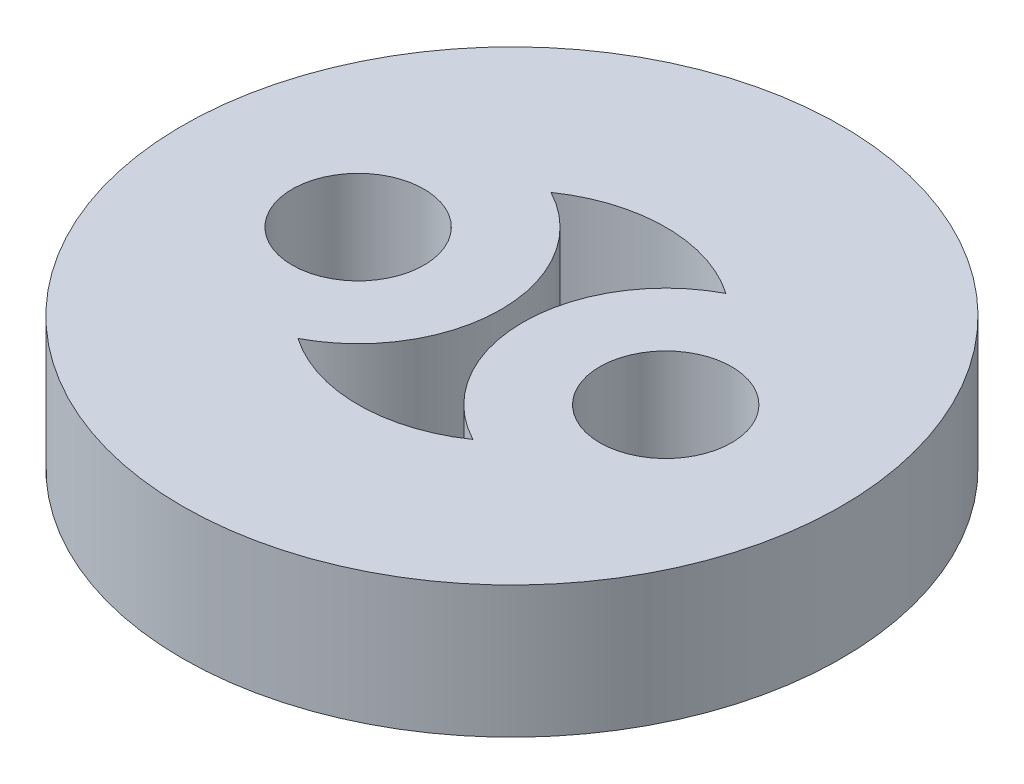
ISO-10303-21;
HEADER;
FILE_DESCRIPTION(('STEP AP214'),'2;1');
FILE_NAME('part.step','',(''),(''),'','','');
FILE_SCHEMA(('AUTOMOTIVE_DESIGN { 1 0 10303 214 1 1 1 1 }'));
ENDSEC;
DATA;
#1=APPLICATION_CONTEXT('core data for automotive mechanical design processes');
#2=APPLICATION_PROTOCOL_DEFINITION('international standard','automotive_design',2000,#1);
#3=PRODUCT_CONTEXT('',#1,'mechanical');
#4=PRODUCT('Part','Part','',(#3));
#5=PRODUCT_RELATED_PRODUCT_CATEGORY('part','',(#4));
#6=PRODUCT_DEFINITION_FORMATION('','',#4);
#7=PRODUCT_DEFINITION_CONTEXT('part definition',#1,'design');
#8=PRODUCT_DEFINITION('design','',#6,#7);
#9=PRODUCT_DEFINITION_SHAPE('','',#8);
#10=(LENGTH_UNIT() NAMED_UNIT(*) SI_UNIT(.MILLI.,.METRE.));
#11=(NAMED_UNIT(*) PLANE_ANGLE_UNIT() SI_UNIT($,.RADIAN.));
#12=(NAMED_UNIT(*) SI_UNIT($,.STERADIAN.) SOLID_ANGLE_UNIT());
#13=UNCERTAINTY_MEASURE_WITH_UNIT(LENGTH_MEASURE(1.E-05),#10,'distance_accuracy_value','');
#14=(GEOMETRIC_REPRESENTATION_CONTEXT(3) GLOBAL_UNCERTAINTY_ASSIGNED_CONTEXT((#13)) GLOBAL_UNIT_ASSIGNED_CONTEXT((#10,
#11,#12)) REPRESENTATION_CONTEXT('',''));
#15=CARTESIAN_POINT('',(0.,0.,0.));
#16=DIRECTION('',(0.,0.,1.));
#17=DIRECTION('',(1.,0.,0.));
#18=AXIS2_PLACEMENT_3D('',#15,#16,#17);
#19=CARTESIAN_POINT('',(0.,3.,0.));
#20=DIRECTION('',(0.,1.,0.));
#21=DIRECTION('',(0.,0.,1.));
#22=AXIS2_PLACEMENT_3D('',#19,#20,#21);
#23=PLANE('',#22);
#24=CARTESIAN_POINT('',(-3.5,3.,0.));
#25=DIRECTION('',(0.,1.,0.));
#26=DIRECTION('',(0.,0.,1.));
#27=AXIS2_PLACEMENT_3D('',#24,#25,#26);
#28=CIRCLE('',#27,1.5);
#29=CARTESIAN_POINT('',(-3.5,3.,1.5));
#30=VERTEX_POINT('',#29);
#31=EDGE_CURVE('E116',#30,#30,#28,.T.);
#32=ORIENTED_EDGE('',*,*,#31,.F.);
#33=EDGE_LOOP('',(#32));
#34=FACE_BOUND('',#33,.T.);
#35=CARTESIAN_POINT('',(0.,3.,0.));
#36=DIRECTION('',(0.,1.,0.));
#37=DIRECTION('',(0.,0.,1.));
#38=AXIS2_PLACEMENT_3D('',#35,#36,#37);
#39=CIRCLE('',#38,7.5);
#40=CARTESIAN_POINT('',(0.,3.,7.5));
#41=VERTEX_POINT('',#40);
#42=EDGE_CURVE('E11',#41,#41,#39,.T.);
#43=ORIENTED_EDGE('',*,*,#42,.T.);
#44=EDGE_LOOP('',(#43));
#45=FACE_BOUND('',#44,.T.);
#46=CARTESIAN_POINT('',(3.5,3.,0.));
#47=DIRECTION('',(0.,1.,0.));
#48=DIRECTION('',(0.,0.,1.));
#49=AXIS2_PLACEMENT_3D('',#46,#47,#48);
#50=CIRCLE('',#49,1.5);
#51=CARTESIAN_POINT('',(3.5,3.,1.5));
#52=VERTEX_POINT('',#51);
#53=EDGE_CURVE('E110',#52,#52,#50,.T.);
#54=ORIENTED_EDGE('',*,*,#53,.F.);
#55=EDGE_LOOP('',(#54));
#56=FACE_BOUND('',#55,.T.);
#57=CARTESIAN_POINT('',(-3.5,3.,0.));
#58=DIRECTION('',(0.,-1.,0.));
#59=DIRECTION('',(0.,0.,1.));
#60=AXIS2_PLACEMENT_3D('',#57,#58,#59);
#61=CIRCLE('',#60,3.25);
#62=CARTESIAN_POINT('',(-1.99107142857143,3.,-2.87847782105865));
#63=VERTEX_POINT('',#62);
#64=CARTESIAN_POINT('',(-1.99107142857143,3.,2.87847782105865));
#65=VERTEX_POINT('',#64);
#66=EDGE_CURVE('E82',#63,#65,#61,.T.);
#67=ORIENTED_EDGE('',*,*,#66,.F.);
#68=CARTESIAN_POINT('',(0.,3.,0.));
#69=DIRECTION('',(0.,1.,0.));
#70=DIRECTION('',(0.,0.,1.));
#71=AXIS2_PLACEMENT_3D('',#68,#69,#70);
#72=CIRCLE('',#71,3.5);
#73=CARTESIAN_POINT('',(1.99107142857143,3.,-2.87847782105865));
#74=VERTEX_POINT('',#73);
#75=EDGE_CURVE('E74',#74,#63,#72,.T.);
#76=ORIENTED_EDGE('',*,*,#75,.F.);
#77=CARTESIAN_POINT('',(3.5,3.,0.));
#78=DIRECTION('',(0.,-1.,0.));
#79=DIRECTION('',(0.,0.,1.));
#80=AXIS2_PLACEMENT_3D('',#77,#78,#79);
#81=CIRCLE('',#80,3.25);
#82=CARTESIAN_POINT('',(1.99107142857143,3.,2.87847782105865));
#83=VERTEX_POINT('',#82);
#84=EDGE_CURVE('E96',#83,#74,#81,.T.);
#85=ORIENTED_EDGE('',*,*,#84,.F.);
#86=CARTESIAN_POINT('',(0.,3.,0.));
#87=DIRECTION('',(0.,1.,0.));
#88=DIRECTION('',(0.,0.,1.));
#89=AXIS2_PLACEMENT_3D('',#86,#87,#88);
#90=CIRCLE('',#89,3.5);
#91=EDGE_CURVE('E94',#65,#83,#90,.T.);
#92=ORIENTED_EDGE('',*,*,#91,.F.);
#93=EDGE_LOOP('',(#67,#76,#85,#92));
#94=FACE_BOUND('',#93,.T.);
#95=ADVANCED_FACE('F33',(#34,#45,#56,#94),#23,.T.);
#96=CARTESIAN_POINT('',(0.,0.,0.));
#97=DIRECTION('',(0.,1.,0.));
#98=DIRECTION('',(0.,0.,1.));
#99=AXIS2_PLACEMENT_3D('',#96,#97,#98);
#100=PLANE('',#99);
#101=CARTESIAN_POINT('',(3.5,0.,0.));
#102=DIRECTION('',(0.,1.,0.));
#103=DIRECTION('',(0.,0.,1.));
#104=AXIS2_PLACEMENT_3D('',#101,#102,#103);
#105=CIRCLE('',#104,1.5);
#106=CARTESIAN_POINT('',(3.5,0.,1.5));
#107=VERTEX_POINT('',#106);
#108=EDGE_CURVE('E90',#107,#107,#105,.T.);
#109=ORIENTED_EDGE('',*,*,#108,.T.);
#110=EDGE_LOOP('',(#109));
#111=FACE_BOUND('',#110,.T.);
#112=CARTESIAN_POINT('',(-3.5,0.,0.));
#113=DIRECTION('',(0.,1.,0.));
#114=DIRECTION('',(0.,0.,1.));
#115=AXIS2_PLACEMENT_3D('',#112,#113,#114);
#116=CIRCLE('',#115,1.5);
#117=CARTESIAN_POINT('',(-3.5,0.,1.5));
#118=VERTEX_POINT('',#117);
#119=EDGE_CURVE('E113',#118,#118,#116,.T.);
#120=ORIENTED_EDGE('',*,*,#119,.T.);
#121=EDGE_LOOP('',(#120));
#122=FACE_BOUND('',#121,.T.);
#123=CARTESIAN_POINT('',(0.,0.,0.));
#124=DIRECTION('',(0.,1.,0.));
#125=DIRECTION('',(0.,0.,1.));
#126=AXIS2_PLACEMENT_3D('',#123,#124,#125);
#127=CIRCLE('',#126,7.5);
#128=CARTESIAN_POINT('',(0.,0.,7.5));
#129=VERTEX_POINT('',#128);
#130=EDGE_CURVE('E37',#129,#129,#127,.T.);
#131=ORIENTED_EDGE('',*,*,#130,.F.);
#132=EDGE_LOOP('',(#131));
#133=FACE_BOUND('',#132,.T.);
#134=CARTESIAN_POINT('',(0.,0.,0.));
#135=DIRECTION('',(0.,1.,0.));
#136=DIRECTION('',(0.,0.,1.));
#137=AXIS2_PLACEMENT_3D('',#134,#135,#136);
#138=CIRCLE('',#137,3.5);
#139=CARTESIAN_POINT('',(1.99107142857143,0.,-2.87847782105865));
#140=VERTEX_POINT('',#139);
#141=CARTESIAN_POINT('',(-1.99107142857143,0.,-2.87847782105865));
#142=VERTEX_POINT('',#141);
#143=EDGE_CURVE('E56',#140,#142,#138,.T.);
#144=ORIENTED_EDGE('',*,*,#143,.T.);
#145=CARTESIAN_POINT('',(-3.5,0.,0.));
#146=DIRECTION('',(0.,-1.,0.));
#147=DIRECTION('',(0.,0.,1.));
#148=AXIS2_PLACEMENT_3D('',#145,#146,#147);
#149=CIRCLE('',#148,3.25);
#150=CARTESIAN_POINT('',(-1.99107142857143,0.,2.87847782105865));
#151=VERTEX_POINT('',#150);
#152=EDGE_CURVE('E89',#142,#151,#149,.T.);
#153=ORIENTED_EDGE('',*,*,#152,.T.);
#154=CARTESIAN_POINT('',(0.,0.,0.));
#155=DIRECTION('',(0.,1.,0.));
#156=DIRECTION('',(0.,0.,1.));
#157=AXIS2_PLACEMENT_3D('',#154,#155,#156);
#158=CIRCLE('',#157,3.5);
#159=CARTESIAN_POINT('',(1.99107142857143,0.,2.87847782105865));
#160=VERTEX_POINT('',#159);
#161=EDGE_CURVE('E102',#151,#160,#158,.T.);
#162=ORIENTED_EDGE('',*,*,#161,.T.);
#163=CARTESIAN_POINT('',(3.5,0.,0.));
#164=DIRECTION('',(0.,-1.,0.));
#165=DIRECTION('',(0.,0.,1.));
#166=AXIS2_PLACEMENT_3D('',#163,#164,#165);
#167=CIRCLE('',#166,3.25);
#168=EDGE_CURVE('E83',#160,#140,#167,.T.);
#169=ORIENTED_EDGE('',*,*,#168,.T.);
#170=EDGE_LOOP('',(#144,#153,#162,#169));
#171=FACE_BOUND('',#170,.T.);
#172=ADVANCED_FACE('F122',(#111,#122,#133,#171),#100,.F.);
#173=CARTESIAN_POINT('',(0.,3.,0.));
#174=DIRECTION('',(0.,-1.,0.));
#175=DIRECTION('',(0.,0.,-1.));
#176=AXIS2_PLACEMENT_3D('',#173,#174,#175);
#177=CYLINDRICAL_SURFACE('',#176,7.5);
#178=ORIENTED_EDGE('',*,*,#42,.F.);
#179=EDGE_LOOP('',(#178));
#180=FACE_BOUND('',#179,.T.);
#181=ORIENTED_EDGE('',*,*,#130,.T.);
#182=EDGE_LOOP('',(#181));
#183=FACE_BOUND('',#182,.T.);
#184=ADVANCED_FACE('F35',(#180,#183),#177,.T.);
#185=CARTESIAN_POINT('',(-3.5,3.,0.));
#186=DIRECTION('',(0.,-1.,0.));
#187=DIRECTION('',(0.,0.,-1.));
#188=AXIS2_PLACEMENT_3D('',#185,#186,#187);
#189=CYLINDRICAL_SURFACE('',#188,1.5);
#190=ORIENTED_EDGE('',*,*,#31,.T.);
#191=EDGE_LOOP('',(#190));
#192=FACE_BOUND('',#191,.T.);
#193=ORIENTED_EDGE('',*,*,#119,.F.);
#194=EDGE_LOOP('',(#193));
#195=FACE_BOUND('',#194,.T.);
#196=ADVANCED_FACE('F125',(#192,#195),#189,.F.);
#197=CARTESIAN_POINT('',(3.5,3.,0.));
#198=DIRECTION('',(0.,-1.,0.));
#199=DIRECTION('',(0.,0.,-1.));
#200=AXIS2_PLACEMENT_3D('',#197,#198,#199);
#201=CYLINDRICAL_SURFACE('',#200,1.5);
#202=ORIENTED_EDGE('',*,*,#53,.T.);
#203=EDGE_LOOP('',(#202));
#204=FACE_BOUND('',#203,.T.);
#205=ORIENTED_EDGE('',*,*,#108,.F.);
#206=EDGE_LOOP('',(#205));
#207=FACE_BOUND('',#206,.T.);
#208=ADVANCED_FACE('F127',(#204,#207),#201,.F.);
#209=CARTESIAN_POINT('',(0.,3.,0.));
#210=DIRECTION('',(0.,-1.,0.));
#211=DIRECTION('',(0.,0.,-1.));
#212=AXIS2_PLACEMENT_3D('',#209,#210,#211);
#213=CYLINDRICAL_SURFACE('',#212,3.5);
#214=ORIENTED_EDGE('',*,*,#143,.F.);
#215=DIRECTION('',(0.,-1.,0.));
#216=VECTOR('',#215,1.);
#217=CARTESIAN_POINT('',(1.99107142857143,3.,-2.87847782105865));
#218=LINE('',#217,#216);
#219=EDGE_CURVE('E78',#74,#140,#218,.T.);
#220=ORIENTED_EDGE('',*,*,#219,.F.);
#221=ORIENTED_EDGE('',*,*,#75,.T.);
#222=DIRECTION('',(0.,-1.,0.));
#223=VECTOR('',#222,1.);
#224=CARTESIAN_POINT('',(-1.99107142857143,3.,-2.87847782105865));
#225=LINE('',#224,#223);
#226=EDGE_CURVE('E77',#63,#142,#225,.T.);
#227=ORIENTED_EDGE('',*,*,#226,.T.);
#228=EDGE_LOOP('',(#214,#220,#221,#227));
#229=FACE_BOUND('',#228,.T.);
#230=ADVANCED_FACE('F76',(#229),#213,.F.);
#231=CARTESIAN_POINT('',(-3.5,3.,0.));
#232=DIRECTION('',(0.,-1.,0.));
#233=DIRECTION('',(0.,0.,-1.));
#234=AXIS2_PLACEMENT_3D('',#231,#232,#233);
#235=CYLINDRICAL_SURFACE('',#234,3.25);
#236=ORIENTED_EDGE('',*,*,#152,.F.);
#237=ORIENTED_EDGE('',*,*,#226,.F.);
#238=ORIENTED_EDGE('',*,*,#66,.T.);
#239=DIRECTION('',(0.,-1.,0.));
#240=VECTOR('',#239,1.);
#241=CARTESIAN_POINT('',(-1.99107142857143,3.,2.87847782105865));
#242=LINE('',#241,#240);
#243=EDGE_CURVE('E91',#65,#151,#242,.T.);
#244=ORIENTED_EDGE('',*,*,#243,.T.);
#245=EDGE_LOOP('',(#236,#237,#238,#244));
#246=FACE_BOUND('',#245,.T.);
#247=ADVANCED_FACE('F86',(#246),#235,.T.);
#248=CARTESIAN_POINT('',(0.,3.,0.));
#249=DIRECTION('',(0.,-1.,0.));
#250=DIRECTION('',(0.,0.,-1.));
#251=AXIS2_PLACEMENT_3D('',#248,#249,#250);
#252=CYLINDRICAL_SURFACE('',#251,3.5);
#253=ORIENTED_EDGE('',*,*,#161,.F.);
#254=ORIENTED_EDGE('',*,*,#243,.F.);
#255=ORIENTED_EDGE('',*,*,#91,.T.);
#256=DIRECTION('',(0.,-1.,0.));
#257=VECTOR('',#256,1.);
#258=CARTESIAN_POINT('',(1.99107142857143,3.,2.87847782105865));
#259=LINE('',#258,#257);
#260=EDGE_CURVE('E48',#83,#160,#259,.T.);
#261=ORIENTED_EDGE('',*,*,#260,.T.);
#262=EDGE_LOOP('',(#253,#254,#255,#261));
#263=FACE_BOUND('',#262,.T.);
#264=ADVANCED_FACE('F158',(#263),#252,.F.);
#265=CARTESIAN_POINT('',(3.5,3.,0.));
#266=DIRECTION('',(0.,-1.,0.));
#267=DIRECTION('',(0.,0.,-1.));
#268=AXIS2_PLACEMENT_3D('',#265,#266,#267);
#269=CYLINDRICAL_SURFACE('',#268,3.25);
#270=ORIENTED_EDGE('',*,*,#168,.F.);
#271=ORIENTED_EDGE('',*,*,#260,.F.);
#272=ORIENTED_EDGE('',*,*,#84,.T.);
#273=ORIENTED_EDGE('',*,*,#219,.T.);
#274=EDGE_LOOP('',(#270,#271,#272,#273));
#275=FACE_BOUND('',#274,.T.);
#276=ADVANCED_FACE('F156',(#275),#269,.T.);
#277=CLOSED_SHELL('',(#95,#172,#184,#196,#208,#230,#247,#264,#276));
#278=MANIFOLD_SOLID_BREP('B2',#277);
#279=ADVANCED_BREP_SHAPE_REPRESENTATION('',(#18,#278),#14);
#280=SHAPE_DEFINITION_REPRESENTATION(#9,#279);
ENDSEC;
END-ISO-10303-21;
